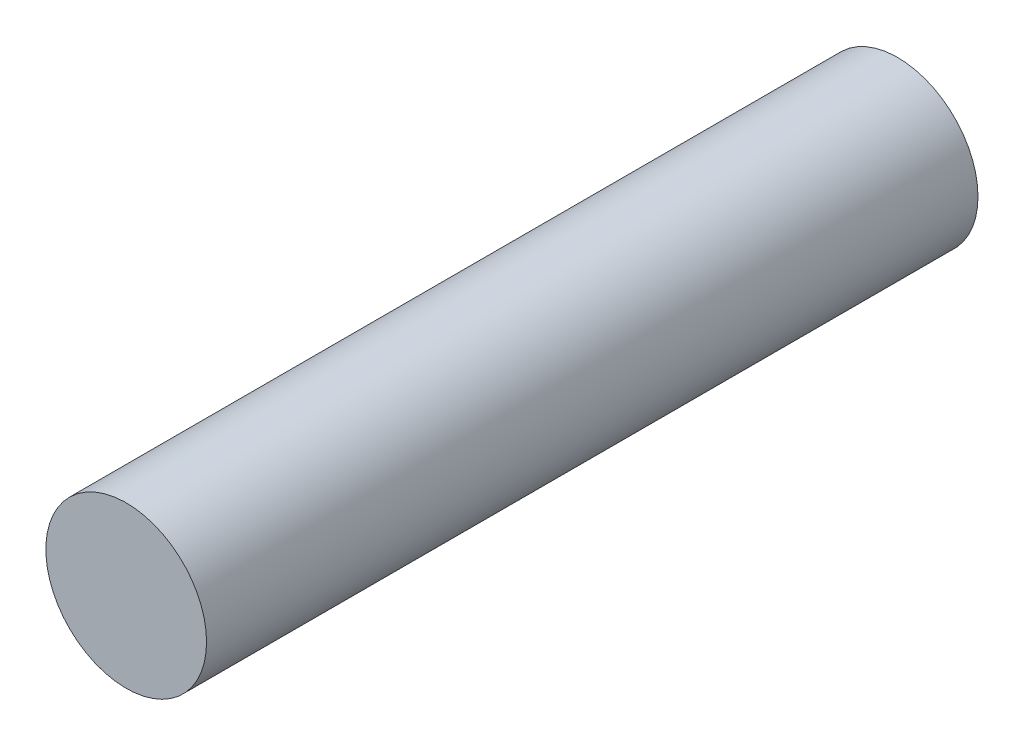
ISO-10303-21;
HEADER;
FILE_DESCRIPTION(('STEP AP214'),'2;1');
FILE_NAME('part.step','',(''),(''),'','','');
FILE_SCHEMA(('AUTOMOTIVE_DESIGN { 1 0 10303 214 1 1 1 1 }'));
ENDSEC;
DATA;
#1=APPLICATION_CONTEXT('core data for automotive mechanical design processes');
#2=APPLICATION_PROTOCOL_DEFINITION('international standard','automotive_design',2000,#1);
#3=PRODUCT_CONTEXT('',#1,'mechanical');
#4=PRODUCT('Part','Part','',(#3));
#5=PRODUCT_RELATED_PRODUCT_CATEGORY('part','',(#4));
#6=PRODUCT_DEFINITION_FORMATION('','',#4);
#7=PRODUCT_DEFINITION_CONTEXT('part definition',#1,'design');
#8=PRODUCT_DEFINITION('design','',#6,#7);
#9=PRODUCT_DEFINITION_SHAPE('','',#8);
#10=(LENGTH_UNIT() NAMED_UNIT(*) SI_UNIT(.MILLI.,.METRE.));
#11=(NAMED_UNIT(*) PLANE_ANGLE_UNIT() SI_UNIT($,.RADIAN.));
#12=(NAMED_UNIT(*) SI_UNIT($,.STERADIAN.) SOLID_ANGLE_UNIT());
#13=UNCERTAINTY_MEASURE_WITH_UNIT(LENGTH_MEASURE(1.E-05),#10,'distance_accuracy_value','');
#14=(GEOMETRIC_REPRESENTATION_CONTEXT(3) GLOBAL_UNCERTAINTY_ASSIGNED_CONTEXT((#13)) GLOBAL_UNIT_ASSIGNED_CONTEXT((#10,
#11,#12)) REPRESENTATION_CONTEXT('',''));
#15=CARTESIAN_POINT('',(0.,0.,0.));
#16=DIRECTION('',(0.,0.,1.));
#17=DIRECTION('',(1.,0.,0.));
#18=AXIS2_PLACEMENT_3D('',#15,#16,#17);
#19=CARTESIAN_POINT('',(0.,0.,24.));
#20=DIRECTION('',(0.,0.,-1.));
#21=DIRECTION('',(-1.,0.,0.));
#22=AXIS2_PLACEMENT_3D('',#19,#20,#21);
#23=CYLINDRICAL_SURFACE('',#22,2.5);
#24=CARTESIAN_POINT('',(0.,0.,24.));
#25=DIRECTION('',(0.,0.,1.));
#26=DIRECTION('',(1.,0.,0.));
#27=AXIS2_PLACEMENT_3D('',#24,#25,#26);
#28=CIRCLE('',#27,2.5);
#29=CARTESIAN_POINT('',(2.5,0.,24.));
#30=VERTEX_POINT('',#29);
#31=EDGE_CURVE('E10',#30,#30,#28,.T.);
#32=ORIENTED_EDGE('',*,*,#31,.F.);
#33=EDGE_LOOP('',(#32));
#34=FACE_BOUND('',#33,.T.);
#35=CARTESIAN_POINT('',(0.,0.,0.));
#36=DIRECTION('',(0.,0.,1.));
#37=DIRECTION('',(1.,0.,0.));
#38=AXIS2_PLACEMENT_3D('',#35,#36,#37);
#39=CIRCLE('',#38,2.5);
#40=CARTESIAN_POINT('',(2.5,0.,0.));
#41=VERTEX_POINT('',#40);
#42=EDGE_CURVE('E37',#41,#41,#39,.T.);
#43=ORIENTED_EDGE('',*,*,#42,.T.);
#44=EDGE_LOOP('',(#43));
#45=FACE_BOUND('',#44,.T.);
#46=ADVANCED_FACE('F34',(#34,#45),#23,.T.);
#47=CARTESIAN_POINT('',(0.,0.,24.));
#48=DIRECTION('',(0.,0.,1.));
#49=DIRECTION('',(1.,0.,0.));
#50=AXIS2_PLACEMENT_3D('',#47,#48,#49);
#51=PLANE('',#50);
#52=ORIENTED_EDGE('',*,*,#31,.T.);
#53=EDGE_LOOP('',(#52));
#54=FACE_BOUND('',#53,.T.);
#55=ADVANCED_FACE('F49',(#54),#51,.T.);
#56=CARTESIAN_POINT('',(0.,0.,0.));
#57=DIRECTION('',(0.,0.,1.));
#58=DIRECTION('',(1.,0.,0.));
#59=AXIS2_PLACEMENT_3D('',#56,#57,#58);
#60=PLANE('',#59);
#61=ORIENTED_EDGE('',*,*,#42,.F.);
#62=EDGE_LOOP('',(#61));
#63=FACE_BOUND('',#62,.T.);
#64=ADVANCED_FACE('F47',(#63),#60,.F.);
#65=CLOSED_SHELL('',(#46,#55,#64));
#66=MANIFOLD_SOLID_BREP('B2',#65);
#67=ADVANCED_BREP_SHAPE_REPRESENTATION('',(#18,#66),#14);
#68=SHAPE_DEFINITION_REPRESENTATION(#9,#67);
ENDSEC;
END-ISO-10303-21;
